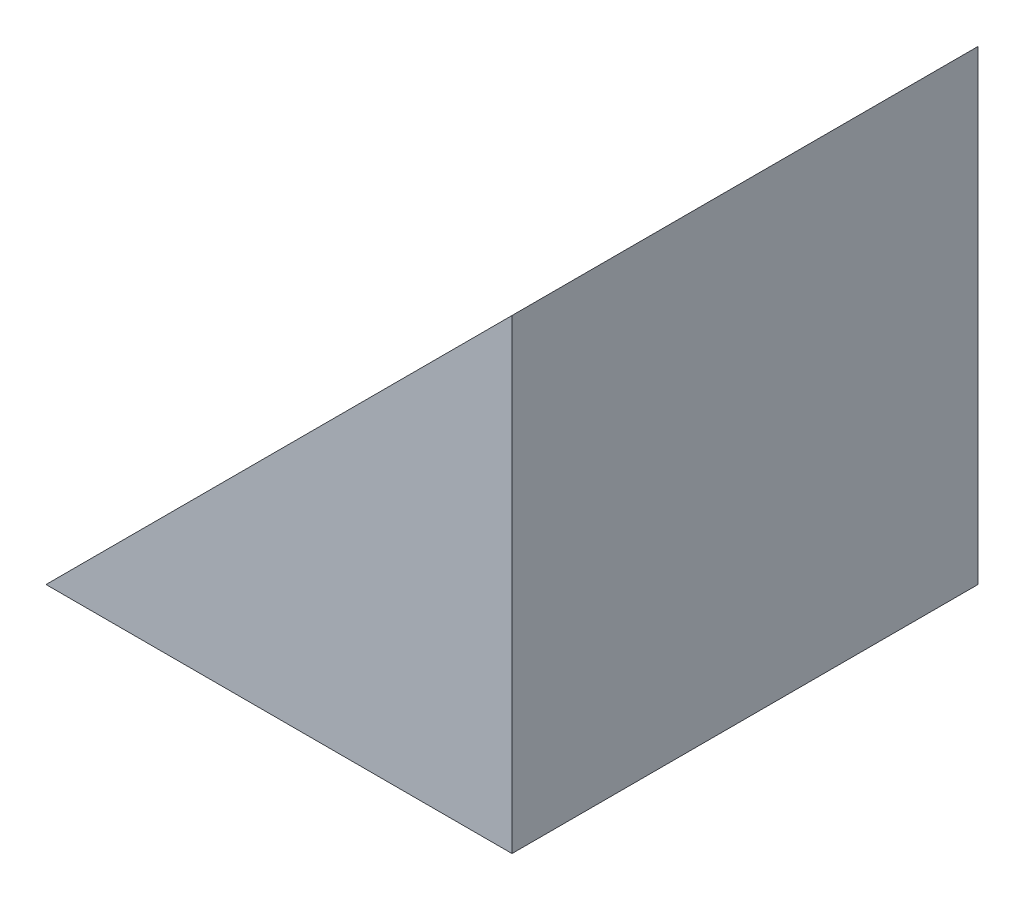
ISO-10303-21;
HEADER;
FILE_DESCRIPTION(('STEP AP214'),'2;1');
FILE_NAME('part.step','',(''),(''),'','','');
FILE_SCHEMA(('AUTOMOTIVE_DESIGN { 1 0 10303 214 1 1 1 1 }'));
ENDSEC;
DATA;
#1=APPLICATION_CONTEXT('core data for automotive mechanical design processes');
#2=APPLICATION_PROTOCOL_DEFINITION('international standard','automotive_design',2000,#1);
#3=PRODUCT_CONTEXT('',#1,'mechanical');
#4=PRODUCT('Part','Part','',(#3));
#5=PRODUCT_RELATED_PRODUCT_CATEGORY('part','',(#4));
#6=PRODUCT_DEFINITION_FORMATION('','',#4);
#7=PRODUCT_DEFINITION_CONTEXT('part definition',#1,'design');
#8=PRODUCT_DEFINITION('design','',#6,#7);
#9=PRODUCT_DEFINITION_SHAPE('','',#8);
#10=(LENGTH_UNIT() NAMED_UNIT(*) SI_UNIT(.MILLI.,.METRE.));
#11=(NAMED_UNIT(*) PLANE_ANGLE_UNIT() SI_UNIT($,.RADIAN.));
#12=(NAMED_UNIT(*) SI_UNIT($,.STERADIAN.) SOLID_ANGLE_UNIT());
#13=UNCERTAINTY_MEASURE_WITH_UNIT(LENGTH_MEASURE(1.E-05),#10,'distance_accuracy_value','');
#14=(GEOMETRIC_REPRESENTATION_CONTEXT(3) GLOBAL_UNCERTAINTY_ASSIGNED_CONTEXT((#13)) GLOBAL_UNIT_ASSIGNED_CONTEXT((#10,
#11,#12)) REPRESENTATION_CONTEXT('',''));
#15=CARTESIAN_POINT('',(0.,0.,0.));
#16=DIRECTION('',(0.,0.,1.));
#17=DIRECTION('',(1.,0.,0.));
#18=AXIS2_PLACEMENT_3D('',#15,#16,#17);
#19=CARTESIAN_POINT('',(43.6785159277265,33.1947675600765,12.5));
#20=DIRECTION('',(0.,1.,0.));
#21=DIRECTION('',(0.,0.,1.));
#22=AXIS2_PLACEMENT_3D('',#19,#20,#21);
#23=PLANE('',#22);
#24=DIRECTION('',(1.,0.,0.));
#25=VECTOR('',#24,1.);
#26=CARTESIAN_POINT('',(43.6785159277265,33.1947675600765,0.));
#27=LINE('',#26,#25);
#28=CARTESIAN_POINT('',(31.1785159277264,33.1947675600765,0.));
#29=VERTEX_POINT('',#28);
#30=CARTESIAN_POINT('',(43.6785159277265,33.1947675600765,0.));
#31=VERTEX_POINT('',#30);
#32=EDGE_CURVE('E82',#29,#31,#27,.T.);
#33=ORIENTED_EDGE('',*,*,#32,.T.);
#34=DIRECTION('',(0.,0.,-1.));
#35=VECTOR('',#34,1.);
#36=CARTESIAN_POINT('',(43.6785159277265,33.1947675600765,12.5));
#37=LINE('',#36,#35);
#38=CARTESIAN_POINT('',(43.6785159277265,33.1947675600765,12.5));
#39=VERTEX_POINT('',#38);
#40=EDGE_CURVE('E11',#39,#31,#37,.T.);
#41=ORIENTED_EDGE('',*,*,#40,.F.);
#42=DIRECTION('',(1.,0.,0.));
#43=VECTOR('',#42,1.);
#44=CARTESIAN_POINT('',(43.6785159277265,33.1947675600765,12.5));
#45=LINE('',#44,#43);
#46=CARTESIAN_POINT('',(31.1785159277264,33.1947675600765,12.5));
#47=VERTEX_POINT('',#46);
#48=EDGE_CURVE('E75',#47,#39,#45,.T.);
#49=ORIENTED_EDGE('',*,*,#48,.F.);
#50=DIRECTION('',(0.,0.,-1.));
#51=VECTOR('',#50,1.);
#52=CARTESIAN_POINT('',(31.1785159277264,33.1947675600765,12.5));
#53=LINE('',#52,#51);
#54=EDGE_CURVE('E83',#47,#29,#53,.T.);
#55=ORIENTED_EDGE('',*,*,#54,.T.);
#56=EDGE_LOOP('',(#33,#41,#49,#55));
#57=FACE_BOUND('',#56,.T.);
#58=ADVANCED_FACE('F35',(#57),#23,.F.);
#59=CARTESIAN_POINT('',(43.6785159277265,33.1947675600765,12.5));
#60=DIRECTION('',(-1.,0.,0.));
#61=DIRECTION('',(0.,0.,1.));
#62=AXIS2_PLACEMENT_3D('',#59,#60,#61);
#63=PLANE('',#62);
#64=DIRECTION('',(0.,1.,0.));
#65=VECTOR('',#64,1.);
#66=CARTESIAN_POINT('',(43.6785159277265,33.1947675600765,0.));
#67=LINE('',#66,#65);
#68=CARTESIAN_POINT('',(43.6785159277265,45.6947675600765,0.));
#69=VERTEX_POINT('',#68);
#70=EDGE_CURVE('E63',#31,#69,#67,.T.);
#71=ORIENTED_EDGE('',*,*,#70,.T.);
#72=DIRECTION('',(0.,0.,-1.));
#73=VECTOR('',#72,1.);
#74=CARTESIAN_POINT('',(43.6785159277265,45.6947675600765,12.5));
#75=LINE('',#74,#73);
#76=CARTESIAN_POINT('',(43.6785159277265,45.6947675600765,12.5));
#77=VERTEX_POINT('',#76);
#78=EDGE_CURVE('E43',#77,#69,#75,.T.);
#79=ORIENTED_EDGE('',*,*,#78,.F.);
#80=DIRECTION('',(0.,1.,0.));
#81=VECTOR('',#80,1.);
#82=CARTESIAN_POINT('',(43.6785159277265,33.1947675600765,12.5));
#83=LINE('',#82,#81);
#84=EDGE_CURVE('E71',#39,#77,#83,.T.);
#85=ORIENTED_EDGE('',*,*,#84,.F.);
#86=ORIENTED_EDGE('',*,*,#40,.T.);
#87=EDGE_LOOP('',(#71,#79,#85,#86));
#88=FACE_BOUND('',#87,.T.);
#89=ADVANCED_FACE('F72',(#88),#63,.F.);
#90=CARTESIAN_POINT('',(31.1785159277264,33.1947675600765,12.5));
#91=DIRECTION('',(0.707106781186548,-0.707106781186548,0.));
#92=DIRECTION('',(0.707106781186548,0.707106781186548,0.));
#93=AXIS2_PLACEMENT_3D('',#90,#91,#92);
#94=PLANE('',#93);
#95=DIRECTION('',(-0.707106781186548,-0.707106781186548,0.));
#96=VECTOR('',#95,1.);
#97=CARTESIAN_POINT('',(31.1785159277264,33.1947675600765,0.));
#98=LINE('',#97,#96);
#99=EDGE_CURVE('E68',#69,#29,#98,.T.);
#100=ORIENTED_EDGE('',*,*,#99,.T.);
#101=ORIENTED_EDGE('',*,*,#54,.F.);
#102=DIRECTION('',(-0.707106781186548,-0.707106781186548,0.));
#103=VECTOR('',#102,1.);
#104=CARTESIAN_POINT('',(31.1785159277264,33.1947675600765,12.5));
#105=LINE('',#104,#103);
#106=EDGE_CURVE('E51',#77,#47,#105,.T.);
#107=ORIENTED_EDGE('',*,*,#106,.F.);
#108=ORIENTED_EDGE('',*,*,#78,.T.);
#109=EDGE_LOOP('',(#100,#101,#107,#108));
#110=FACE_BOUND('',#109,.T.);
#111=ADVANCED_FACE('F90',(#110),#94,.F.);
#112=CARTESIAN_POINT('',(0.,0.,12.5));
#113=DIRECTION('',(0.,0.,-1.));
#114=DIRECTION('',(-1.,0.,0.));
#115=AXIS2_PLACEMENT_3D('',#112,#113,#114);
#116=PLANE('',#115);
#117=ORIENTED_EDGE('',*,*,#48,.T.);
#118=ORIENTED_EDGE('',*,*,#84,.T.);
#119=ORIENTED_EDGE('',*,*,#106,.T.);
#120=EDGE_LOOP('',(#117,#118,#119));
#121=FACE_BOUND('',#120,.T.);
#122=ADVANCED_FACE('F78',(#121),#116,.F.);
#123=CARTESIAN_POINT('',(0.,0.,0.));
#124=DIRECTION('',(0.,0.,-1.));
#125=DIRECTION('',(-1.,0.,0.));
#126=AXIS2_PLACEMENT_3D('',#123,#124,#125);
#127=PLANE('',#126);
#128=ORIENTED_EDGE('',*,*,#32,.F.);
#129=ORIENTED_EDGE('',*,*,#99,.F.);
#130=ORIENTED_EDGE('',*,*,#70,.F.);
#131=EDGE_LOOP('',(#128,#129,#130));
#132=FACE_BOUND('',#131,.T.);
#133=ADVANCED_FACE('F91',(#132),#127,.T.);
#134=CLOSED_SHELL('',(#58,#89,#111,#122,#133));
#135=MANIFOLD_SOLID_BREP('B2',#134);
#136=ADVANCED_BREP_SHAPE_REPRESENTATION('',(#18,#135),#14);
#137=SHAPE_DEFINITION_REPRESENTATION(#9,#136);
ENDSEC;
END-ISO-10303-21;
